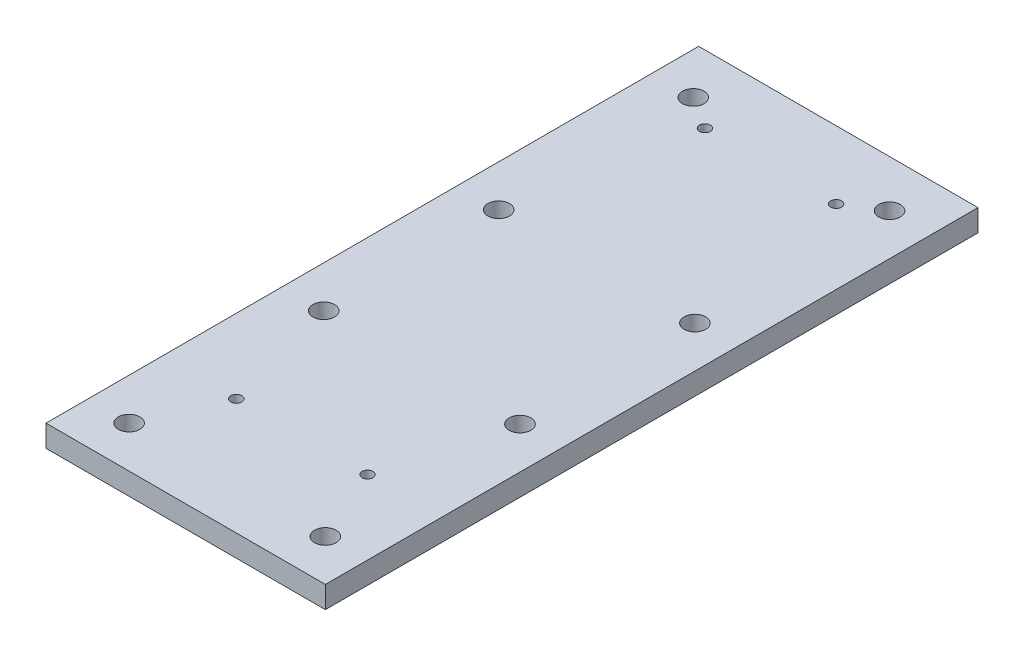
ISO-10303-21;
HEADER;
FILE_DESCRIPTION(('STEP AP214'),'2;1');
FILE_NAME('part.step','',(''),(''),'','','');
FILE_SCHEMA(('AUTOMOTIVE_DESIGN { 1 0 10303 214 1 1 1 1 }'));
ENDSEC;
DATA;
#1=APPLICATION_CONTEXT('core data for automotive mechanical design processes');
#2=APPLICATION_PROTOCOL_DEFINITION('international standard','automotive_design',2000,#1);
#3=PRODUCT_CONTEXT('',#1,'mechanical');
#4=PRODUCT('Part','Part','',(#3));
#5=PRODUCT_RELATED_PRODUCT_CATEGORY('part','',(#4));
#6=PRODUCT_DEFINITION_FORMATION('','',#4);
#7=PRODUCT_DEFINITION_CONTEXT('part definition',#1,'design');
#8=PRODUCT_DEFINITION('design','',#6,#7);
#9=PRODUCT_DEFINITION_SHAPE('','',#8);
#10=(LENGTH_UNIT() NAMED_UNIT(*) SI_UNIT(.MILLI.,.METRE.));
#11=(NAMED_UNIT(*) PLANE_ANGLE_UNIT() SI_UNIT($,.RADIAN.));
#12=(NAMED_UNIT(*) SI_UNIT($,.STERADIAN.) SOLID_ANGLE_UNIT());
#13=UNCERTAINTY_MEASURE_WITH_UNIT(LENGTH_MEASURE(1.E-05),#10,'distance_accuracy_value','');
#14=(GEOMETRIC_REPRESENTATION_CONTEXT(3) GLOBAL_UNCERTAINTY_ASSIGNED_CONTEXT((#13)) GLOBAL_UNIT_ASSIGNED_CONTEXT((#10,
#11,#12)) REPRESENTATION_CONTEXT('',''));
#15=CARTESIAN_POINT('',(0.,0.,0.));
#16=DIRECTION('',(0.,0.,1.));
#17=DIRECTION('',(1.,0.,0.));
#18=AXIS2_PLACEMENT_3D('',#15,#16,#17);
#19=CARTESIAN_POINT('',(0.,10.,0.));
#20=DIRECTION('',(0.,-1.,0.));
#21=DIRECTION('',(0.,0.,-1.));
#22=AXIS2_PLACEMENT_3D('',#19,#20,#21);
#23=PLANE('',#22);
#24=CARTESIAN_POINT('',(33.875,10.,-53.1375));
#25=DIRECTION('',(0.,1.,0.));
#26=DIRECTION('',(0.,0.,1.));
#27=AXIS2_PLACEMENT_3D('',#24,#25,#26);
#28=CIRCLE('',#27,2.5);
#29=CARTESIAN_POINT('',(33.875,10.,-50.6375));
#30=VERTEX_POINT('',#29);
#31=EDGE_CURVE('E178',#30,#30,#28,.T.);
#32=ORIENTED_EDGE('',*,*,#31,.F.);
#33=EDGE_LOOP('',(#32));
#34=FACE_BOUND('',#33,.T.);
#35=CARTESIAN_POINT('',(93.875,10.,-267.45));
#36=DIRECTION('',(0.,1.,0.));
#37=DIRECTION('',(0.,0.,1.));
#38=AXIS2_PLACEMENT_3D('',#35,#36,#37);
#39=CIRCLE('',#38,2.5);
#40=CARTESIAN_POINT('',(93.875,10.,-264.95));
#41=VERTEX_POINT('',#40);
#42=EDGE_CURVE('E184',#41,#41,#39,.T.);
#43=ORIENTED_EDGE('',*,*,#42,.F.);
#44=EDGE_LOOP('',(#43));
#45=FACE_BOUND('',#44,.T.);
#46=CARTESIAN_POINT('',(93.8750000000001,10.,-53.1375));
#47=DIRECTION('',(0.,1.,0.));
#48=DIRECTION('',(0.,0.,1.));
#49=AXIS2_PLACEMENT_3D('',#46,#47,#48);
#50=CIRCLE('',#49,2.5);
#51=CARTESIAN_POINT('',(93.8750000000001,10.,-50.6375));
#52=VERTEX_POINT('',#51);
#53=EDGE_CURVE('E172',#52,#52,#50,.T.);
#54=ORIENTED_EDGE('',*,*,#53,.F.);
#55=EDGE_LOOP('',(#54));
#56=FACE_BOUND('',#55,.T.);
#57=CARTESIAN_POINT('',(33.875,10.,-267.45));
#58=DIRECTION('',(0.,1.,0.));
#59=DIRECTION('',(0.,0.,1.));
#60=AXIS2_PLACEMENT_3D('',#57,#58,#59);
#61=CIRCLE('',#60,2.5);
#62=CARTESIAN_POINT('',(33.875,10.,-264.95));
#63=VERTEX_POINT('',#62);
#64=EDGE_CURVE('E169',#63,#63,#61,.T.);
#65=ORIENTED_EDGE('',*,*,#64,.F.);
#66=EDGE_LOOP('',(#65));
#67=FACE_BOUND('',#66,.T.);
#68=DIRECTION('',(0.,0.,1.));
#69=VECTOR('',#68,1.);
#70=CARTESIAN_POINT('',(0.,10.,0.));
#71=LINE('',#70,#69);
#72=CARTESIAN_POINT('',(0.,10.,-298.45));
#73=VERTEX_POINT('',#72);
#74=CARTESIAN_POINT('',(0.,10.,0.));
#75=VERTEX_POINT('',#74);
#76=EDGE_CURVE('E94',#73,#75,#71,.T.);
#77=ORIENTED_EDGE('',*,*,#76,.T.);
#78=DIRECTION('',(1.,0.,0.));
#79=VECTOR('',#78,1.);
#80=CARTESIAN_POINT('',(0.,10.,0.));
#81=LINE('',#80,#79);
#82=CARTESIAN_POINT('',(127.75,10.,0.));
#83=VERTEX_POINT('',#82);
#84=EDGE_CURVE('E89',#75,#83,#81,.T.);
#85=ORIENTED_EDGE('',*,*,#84,.T.);
#86=DIRECTION('',(0.,0.,-1.));
#87=VECTOR('',#86,1.);
#88=CARTESIAN_POINT('',(127.75,10.,0.));
#89=LINE('',#88,#87);
#90=CARTESIAN_POINT('',(127.75,10.,-298.45));
#91=VERTEX_POINT('',#90);
#92=EDGE_CURVE('E92',#83,#91,#89,.T.);
#93=ORIENTED_EDGE('',*,*,#92,.T.);
#94=DIRECTION('',(-1.,0.,0.));
#95=VECTOR('',#94,1.);
#96=CARTESIAN_POINT('',(0.,10.,-298.45));
#97=LINE('',#96,#95);
#98=EDGE_CURVE('E59',#91,#73,#97,.T.);
#99=ORIENTED_EDGE('',*,*,#98,.T.);
#100=EDGE_LOOP('',(#77,#85,#93,#99));
#101=FACE_BOUND('',#100,.T.);
#102=CARTESIAN_POINT('',(19.,10.,-277.));
#103=DIRECTION('',(0.,1.,0.));
#104=DIRECTION('',(0.,0.,1.));
#105=AXIS2_PLACEMENT_3D('',#102,#103,#104);
#106=CIRCLE('',#105,4.94999999999996);
#107=CARTESIAN_POINT('',(19.,10.,-272.05));
#108=VERTEX_POINT('',#107);
#109=EDGE_CURVE('E109',#108,#108,#106,.T.);
#110=ORIENTED_EDGE('',*,*,#109,.F.);
#111=EDGE_LOOP('',(#110));
#112=FACE_BOUND('',#111,.T.);
#113=CARTESIAN_POINT('',(108.75,10.,-108.));
#114=DIRECTION('',(0.,1.,0.));
#115=DIRECTION('',(0.,0.,1.));
#116=AXIS2_PLACEMENT_3D('',#113,#114,#115);
#117=CIRCLE('',#116,4.94999999999999);
#118=CARTESIAN_POINT('',(108.75,10.,-103.05));
#119=VERTEX_POINT('',#118);
#120=EDGE_CURVE('E124',#119,#119,#117,.T.);
#121=ORIENTED_EDGE('',*,*,#120,.F.);
#122=EDGE_LOOP('',(#121));
#123=FACE_BOUND('',#122,.T.);
#124=CARTESIAN_POINT('',(108.75,10.,-277.));
#125=DIRECTION('',(0.,1.,0.));
#126=DIRECTION('',(0.,0.,1.));
#127=AXIS2_PLACEMENT_3D('',#124,#125,#126);
#128=CIRCLE('',#127,4.94999999999995);
#129=CARTESIAN_POINT('',(108.75,10.,-272.05));
#130=VERTEX_POINT('',#129);
#131=EDGE_CURVE('E130',#130,#130,#128,.T.);
#132=ORIENTED_EDGE('',*,*,#131,.F.);
#133=EDGE_LOOP('',(#132));
#134=FACE_BOUND('',#133,.T.);
#135=CARTESIAN_POINT('',(19.,10.,-188.));
#136=DIRECTION('',(0.,1.,0.));
#137=DIRECTION('',(0.,0.,1.));
#138=AXIS2_PLACEMENT_3D('',#135,#136,#137);
#139=CIRCLE('',#138,4.95000000000001);
#140=CARTESIAN_POINT('',(19.,10.,-183.05));
#141=VERTEX_POINT('',#140);
#142=EDGE_CURVE('E136',#141,#141,#139,.T.);
#143=ORIENTED_EDGE('',*,*,#142,.F.);
#144=EDGE_LOOP('',(#143));
#145=FACE_BOUND('',#144,.T.);
#146=CARTESIAN_POINT('',(108.75,10.,-19.));
#147=DIRECTION('',(0.,1.,0.));
#148=DIRECTION('',(0.,0.,1.));
#149=AXIS2_PLACEMENT_3D('',#146,#147,#148);
#150=CIRCLE('',#149,4.94999999999999);
#151=CARTESIAN_POINT('',(108.75,10.,-14.05));
#152=VERTEX_POINT('',#151);
#153=EDGE_CURVE('E142',#152,#152,#150,.T.);
#154=ORIENTED_EDGE('',*,*,#153,.F.);
#155=EDGE_LOOP('',(#154));
#156=FACE_BOUND('',#155,.T.);
#157=CARTESIAN_POINT('',(108.75,10.,-188.));
#158=DIRECTION('',(0.,1.,0.));
#159=DIRECTION('',(0.,0.,1.));
#160=AXIS2_PLACEMENT_3D('',#157,#158,#159);
#161=CIRCLE('',#160,4.95);
#162=CARTESIAN_POINT('',(108.75,10.,-183.05));
#163=VERTEX_POINT('',#162);
#164=EDGE_CURVE('E148',#163,#163,#161,.T.);
#165=ORIENTED_EDGE('',*,*,#164,.F.);
#166=EDGE_LOOP('',(#165));
#167=FACE_BOUND('',#166,.T.);
#168=CARTESIAN_POINT('',(19.,10.,-108.));
#169=DIRECTION('',(0.,1.,0.));
#170=DIRECTION('',(0.,0.,1.));
#171=AXIS2_PLACEMENT_3D('',#168,#169,#170);
#172=CIRCLE('',#171,4.95);
#173=CARTESIAN_POINT('',(19.,10.,-103.05));
#174=VERTEX_POINT('',#173);
#175=EDGE_CURVE('E154',#174,#174,#172,.T.);
#176=ORIENTED_EDGE('',*,*,#175,.F.);
#177=EDGE_LOOP('',(#176));
#178=FACE_BOUND('',#177,.T.);
#179=CARTESIAN_POINT('',(19.,10.,-19.));
#180=DIRECTION('',(0.,1.,0.));
#181=DIRECTION('',(0.,0.,1.));
#182=AXIS2_PLACEMENT_3D('',#179,#180,#181);
#183=CIRCLE('',#182,4.95);
#184=CARTESIAN_POINT('',(19.,10.,-14.05));
#185=VERTEX_POINT('',#184);
#186=EDGE_CURVE('E160',#185,#185,#183,.T.);
#187=ORIENTED_EDGE('',*,*,#186,.F.);
#188=EDGE_LOOP('',(#187));
#189=FACE_BOUND('',#188,.T.);
#190=ADVANCED_FACE('F42',(#34,#45,#56,#67,#101,#112,#123,#134,#145,#156,#167,#178,#189),#23,.F.);
#191=CARTESIAN_POINT('',(0.,0.,0.));
#192=DIRECTION('',(0.,-1.,0.));
#193=DIRECTION('',(0.,0.,-1.));
#194=AXIS2_PLACEMENT_3D('',#191,#192,#193);
#195=PLANE('',#194);
#196=CARTESIAN_POINT('',(33.875,0.,-53.1375));
#197=DIRECTION('',(0.,1.,0.));
#198=DIRECTION('',(0.,0.,1.));
#199=AXIS2_PLACEMENT_3D('',#196,#197,#198);
#200=CIRCLE('',#199,2.5);
#201=CARTESIAN_POINT('',(33.875,0.,-50.6375));
#202=VERTEX_POINT('',#201);
#203=EDGE_CURVE('E175',#202,#202,#200,.T.);
#204=ORIENTED_EDGE('',*,*,#203,.T.);
#205=EDGE_LOOP('',(#204));
#206=FACE_BOUND('',#205,.T.);
#207=CARTESIAN_POINT('',(93.875,0.,-267.45));
#208=DIRECTION('',(0.,1.,0.));
#209=DIRECTION('',(0.,0.,1.));
#210=AXIS2_PLACEMENT_3D('',#207,#208,#209);
#211=CIRCLE('',#210,2.5);
#212=CARTESIAN_POINT('',(93.875,0.,-264.95));
#213=VERTEX_POINT('',#212);
#214=EDGE_CURVE('E181',#213,#213,#211,.T.);
#215=ORIENTED_EDGE('',*,*,#214,.T.);
#216=EDGE_LOOP('',(#215));
#217=FACE_BOUND('',#216,.T.);
#218=CARTESIAN_POINT('',(93.8750000000001,0.,-53.1375));
#219=DIRECTION('',(0.,1.,0.));
#220=DIRECTION('',(0.,0.,1.));
#221=AXIS2_PLACEMENT_3D('',#218,#219,#220);
#222=CIRCLE('',#221,2.5);
#223=CARTESIAN_POINT('',(93.8750000000001,0.,-50.6375));
#224=VERTEX_POINT('',#223);
#225=EDGE_CURVE('E187',#224,#224,#222,.T.);
#226=ORIENTED_EDGE('',*,*,#225,.T.);
#227=EDGE_LOOP('',(#226));
#228=FACE_BOUND('',#227,.T.);
#229=CARTESIAN_POINT('',(33.875,0.,-267.45));
#230=DIRECTION('',(0.,1.,0.));
#231=DIRECTION('',(0.,0.,1.));
#232=AXIS2_PLACEMENT_3D('',#229,#230,#231);
#233=CIRCLE('',#232,2.5);
#234=CARTESIAN_POINT('',(33.875,0.,-264.95));
#235=VERTEX_POINT('',#234);
#236=EDGE_CURVE('E166',#235,#235,#233,.T.);
#237=ORIENTED_EDGE('',*,*,#236,.T.);
#238=EDGE_LOOP('',(#237));
#239=FACE_BOUND('',#238,.T.);
#240=CARTESIAN_POINT('',(19.,0.,-108.));
#241=DIRECTION('',(0.,1.,0.));
#242=DIRECTION('',(0.,0.,1.));
#243=AXIS2_PLACEMENT_3D('',#240,#241,#242);
#244=CIRCLE('',#243,4.95);
#245=CARTESIAN_POINT('',(19.,0.,-103.05));
#246=VERTEX_POINT('',#245);
#247=EDGE_CURVE('E157',#246,#246,#244,.T.);
#248=ORIENTED_EDGE('',*,*,#247,.T.);
#249=EDGE_LOOP('',(#248));
#250=FACE_BOUND('',#249,.T.);
#251=CARTESIAN_POINT('',(108.75,0.,-19.));
#252=DIRECTION('',(0.,1.,0.));
#253=DIRECTION('',(0.,0.,1.));
#254=AXIS2_PLACEMENT_3D('',#251,#252,#253);
#255=CIRCLE('',#254,4.94999999999999);
#256=CARTESIAN_POINT('',(108.75,0.,-14.05));
#257=VERTEX_POINT('',#256);
#258=EDGE_CURVE('E145',#257,#257,#255,.T.);
#259=ORIENTED_EDGE('',*,*,#258,.T.);
#260=EDGE_LOOP('',(#259));
#261=FACE_BOUND('',#260,.T.);
#262=CARTESIAN_POINT('',(108.75,0.,-277.));
#263=DIRECTION('',(0.,1.,0.));
#264=DIRECTION('',(0.,0.,1.));
#265=AXIS2_PLACEMENT_3D('',#262,#263,#264);
#266=CIRCLE('',#265,4.94999999999995);
#267=CARTESIAN_POINT('',(108.75,0.,-272.05));
#268=VERTEX_POINT('',#267);
#269=EDGE_CURVE('E133',#268,#268,#266,.T.);
#270=ORIENTED_EDGE('',*,*,#269,.T.);
#271=EDGE_LOOP('',(#270));
#272=FACE_BOUND('',#271,.T.);
#273=CARTESIAN_POINT('',(19.,0.,-277.));
#274=DIRECTION('',(0.,1.,0.));
#275=DIRECTION('',(0.,0.,1.));
#276=AXIS2_PLACEMENT_3D('',#273,#274,#275);
#277=CIRCLE('',#276,4.94999999999996);
#278=CARTESIAN_POINT('',(19.,0.,-272.05));
#279=VERTEX_POINT('',#278);
#280=EDGE_CURVE('E121',#279,#279,#277,.T.);
#281=ORIENTED_EDGE('',*,*,#280,.T.);
#282=EDGE_LOOP('',(#281));
#283=FACE_BOUND('',#282,.T.);
#284=DIRECTION('',(0.,0.,1.));
#285=VECTOR('',#284,1.);
#286=CARTESIAN_POINT('',(0.,0.,0.));
#287=LINE('',#286,#285);
#288=CARTESIAN_POINT('',(0.,0.,-298.45));
#289=VERTEX_POINT('',#288);
#290=CARTESIAN_POINT('',(0.,0.,0.));
#291=VERTEX_POINT('',#290);
#292=EDGE_CURVE('E106',#289,#291,#287,.T.);
#293=ORIENTED_EDGE('',*,*,#292,.F.);
#294=DIRECTION('',(-1.,0.,0.));
#295=VECTOR('',#294,1.);
#296=CARTESIAN_POINT('',(0.,0.,-298.45));
#297=LINE('',#296,#295);
#298=CARTESIAN_POINT('',(127.75,0.,-298.45));
#299=VERTEX_POINT('',#298);
#300=EDGE_CURVE('E82',#299,#289,#297,.T.);
#301=ORIENTED_EDGE('',*,*,#300,.F.);
#302=DIRECTION('',(0.,0.,-1.));
#303=VECTOR('',#302,1.);
#304=CARTESIAN_POINT('',(127.75,0.,0.));
#305=LINE('',#304,#303);
#306=CARTESIAN_POINT('',(127.75,0.,0.));
#307=VERTEX_POINT('',#306);
#308=EDGE_CURVE('E76',#307,#299,#305,.T.);
#309=ORIENTED_EDGE('',*,*,#308,.F.);
#310=DIRECTION('',(1.,0.,0.));
#311=VECTOR('',#310,1.);
#312=CARTESIAN_POINT('',(0.,0.,0.));
#313=LINE('',#312,#311);
#314=EDGE_CURVE('E98',#291,#307,#313,.T.);
#315=ORIENTED_EDGE('',*,*,#314,.F.);
#316=EDGE_LOOP('',(#293,#301,#309,#315));
#317=FACE_BOUND('',#316,.T.);
#318=CARTESIAN_POINT('',(108.75,0.,-108.));
#319=DIRECTION('',(0.,1.,0.));
#320=DIRECTION('',(0.,0.,1.));
#321=AXIS2_PLACEMENT_3D('',#318,#319,#320);
#322=CIRCLE('',#321,4.94999999999999);
#323=CARTESIAN_POINT('',(108.75,0.,-103.05));
#324=VERTEX_POINT('',#323);
#325=EDGE_CURVE('E127',#324,#324,#322,.T.);
#326=ORIENTED_EDGE('',*,*,#325,.T.);
#327=EDGE_LOOP('',(#326));
#328=FACE_BOUND('',#327,.T.);
#329=CARTESIAN_POINT('',(19.,0.,-188.));
#330=DIRECTION('',(0.,1.,0.));
#331=DIRECTION('',(0.,0.,1.));
#332=AXIS2_PLACEMENT_3D('',#329,#330,#331);
#333=CIRCLE('',#332,4.95000000000001);
#334=CARTESIAN_POINT('',(19.,0.,-183.05));
#335=VERTEX_POINT('',#334);
#336=EDGE_CURVE('E139',#335,#335,#333,.T.);
#337=ORIENTED_EDGE('',*,*,#336,.T.);
#338=EDGE_LOOP('',(#337));
#339=FACE_BOUND('',#338,.T.);
#340=CARTESIAN_POINT('',(108.75,0.,-188.));
#341=DIRECTION('',(0.,1.,0.));
#342=DIRECTION('',(0.,0.,1.));
#343=AXIS2_PLACEMENT_3D('',#340,#341,#342);
#344=CIRCLE('',#343,4.95);
#345=CARTESIAN_POINT('',(108.75,0.,-183.05));
#346=VERTEX_POINT('',#345);
#347=EDGE_CURVE('E151',#346,#346,#344,.T.);
#348=ORIENTED_EDGE('',*,*,#347,.T.);
#349=EDGE_LOOP('',(#348));
#350=FACE_BOUND('',#349,.T.);
#351=CARTESIAN_POINT('',(19.,0.,-19.));
#352=DIRECTION('',(0.,1.,0.));
#353=DIRECTION('',(0.,0.,1.));
#354=AXIS2_PLACEMENT_3D('',#351,#352,#353);
#355=CIRCLE('',#354,4.95);
#356=CARTESIAN_POINT('',(19.,0.,-14.05));
#357=VERTEX_POINT('',#356);
#358=EDGE_CURVE('E163',#357,#357,#355,.T.);
#359=ORIENTED_EDGE('',*,*,#358,.T.);
#360=EDGE_LOOP('',(#359));
#361=FACE_BOUND('',#360,.T.);
#362=ADVANCED_FACE('F117',(#206,#217,#228,#239,#250,#261,#272,#283,#317,#328,#339,#350,#361),
#195,.T.);
#363=CARTESIAN_POINT('',(0.,10.,0.));
#364=DIRECTION('',(1.,0.,0.));
#365=DIRECTION('',(0.,0.,-1.));
#366=AXIS2_PLACEMENT_3D('',#363,#364,#365);
#367=PLANE('',#366);
#368=ORIENTED_EDGE('',*,*,#292,.T.);
#369=DIRECTION('',(0.,-1.,0.));
#370=VECTOR('',#369,1.);
#371=CARTESIAN_POINT('',(0.,10.,0.));
#372=LINE('',#371,#370);
#373=EDGE_CURVE('E11',#75,#291,#372,.T.);
#374=ORIENTED_EDGE('',*,*,#373,.F.);
#375=ORIENTED_EDGE('',*,*,#76,.F.);
#376=DIRECTION('',(0.,-1.,0.));
#377=VECTOR('',#376,1.);
#378=CARTESIAN_POINT('',(0.,10.,-298.45));
#379=LINE('',#378,#377);
#380=EDGE_CURVE('E102',#73,#289,#379,.T.);
#381=ORIENTED_EDGE('',*,*,#380,.T.);
#382=EDGE_LOOP('',(#368,#374,#375,#381));
#383=FACE_BOUND('',#382,.T.);
#384=ADVANCED_FACE('F44',(#383),#367,.F.);
#385=CARTESIAN_POINT('',(0.,10.,0.));
#386=DIRECTION('',(0.,0.,-1.));
#387=DIRECTION('',(-1.,0.,0.));
#388=AXIS2_PLACEMENT_3D('',#385,#386,#387);
#389=PLANE('',#388);
#390=ORIENTED_EDGE('',*,*,#314,.T.);
#391=DIRECTION('',(0.,-1.,0.));
#392=VECTOR('',#391,1.);
#393=CARTESIAN_POINT('',(127.75,10.,0.));
#394=LINE('',#393,#392);
#395=EDGE_CURVE('E51',#83,#307,#394,.T.);
#396=ORIENTED_EDGE('',*,*,#395,.F.);
#397=ORIENTED_EDGE('',*,*,#84,.F.);
#398=ORIENTED_EDGE('',*,*,#373,.T.);
#399=EDGE_LOOP('',(#390,#396,#397,#398));
#400=FACE_BOUND('',#399,.T.);
#401=ADVANCED_FACE('F97',(#400),#389,.F.);
#402=CARTESIAN_POINT('',(127.75,10.,0.));
#403=DIRECTION('',(-1.,0.,0.));
#404=DIRECTION('',(0.,0.,1.));
#405=AXIS2_PLACEMENT_3D('',#402,#403,#404);
#406=PLANE('',#405);
#407=ORIENTED_EDGE('',*,*,#308,.T.);
#408=DIRECTION('',(0.,-1.,0.));
#409=VECTOR('',#408,1.);
#410=CARTESIAN_POINT('',(127.75,10.,-298.45));
#411=LINE('',#410,#409);
#412=EDGE_CURVE('E99',#91,#299,#411,.T.);
#413=ORIENTED_EDGE('',*,*,#412,.F.);
#414=ORIENTED_EDGE('',*,*,#92,.F.);
#415=ORIENTED_EDGE('',*,*,#395,.T.);
#416=EDGE_LOOP('',(#407,#413,#414,#415));
#417=FACE_BOUND('',#416,.T.);
#418=ADVANCED_FACE('F100',(#417),#406,.F.);
#419=CARTESIAN_POINT('',(0.,10.,-298.45));
#420=DIRECTION('',(0.,0.,1.));
#421=DIRECTION('',(1.,0.,0.));
#422=AXIS2_PLACEMENT_3D('',#419,#420,#421);
#423=PLANE('',#422);
#424=ORIENTED_EDGE('',*,*,#300,.T.);
#425=ORIENTED_EDGE('',*,*,#380,.F.);
#426=ORIENTED_EDGE('',*,*,#98,.F.);
#427=ORIENTED_EDGE('',*,*,#412,.T.);
#428=EDGE_LOOP('',(#424,#425,#426,#427));
#429=FACE_BOUND('',#428,.T.);
#430=ADVANCED_FACE('F114',(#429),#423,.F.);
#431=CARTESIAN_POINT('',(19.,10.,-277.));
#432=DIRECTION('',(0.,-1.,0.));
#433=DIRECTION('',(0.,0.,-1.));
#434=AXIS2_PLACEMENT_3D('',#431,#432,#433);
#435=CYLINDRICAL_SURFACE('',#434,4.94999999999996);
#436=ORIENTED_EDGE('',*,*,#109,.T.);
#437=EDGE_LOOP('',(#436));
#438=FACE_BOUND('',#437,.T.);
#439=ORIENTED_EDGE('',*,*,#280,.F.);
#440=EDGE_LOOP('',(#439));
#441=FACE_BOUND('',#440,.T.);
#442=ADVANCED_FACE('F243',(#438,#441),#435,.F.);
#443=CARTESIAN_POINT('',(108.75,10.,-108.));
#444=DIRECTION('',(0.,-1.,0.));
#445=DIRECTION('',(0.,0.,-1.));
#446=AXIS2_PLACEMENT_3D('',#443,#444,#445);
#447=CYLINDRICAL_SURFACE('',#446,4.94999999999999);
#448=ORIENTED_EDGE('',*,*,#120,.T.);
#449=EDGE_LOOP('',(#448));
#450=FACE_BOUND('',#449,.T.);
#451=ORIENTED_EDGE('',*,*,#325,.F.);
#452=EDGE_LOOP('',(#451));
#453=FACE_BOUND('',#452,.T.);
#454=ADVANCED_FACE('F239',(#450,#453),#447,.F.);
#455=CARTESIAN_POINT('',(108.75,10.,-277.));
#456=DIRECTION('',(0.,-1.,0.));
#457=DIRECTION('',(0.,0.,-1.));
#458=AXIS2_PLACEMENT_3D('',#455,#456,#457);
#459=CYLINDRICAL_SURFACE('',#458,4.94999999999995);
#460=ORIENTED_EDGE('',*,*,#131,.T.);
#461=EDGE_LOOP('',(#460));
#462=FACE_BOUND('',#461,.T.);
#463=ORIENTED_EDGE('',*,*,#269,.F.);
#464=EDGE_LOOP('',(#463));
#465=FACE_BOUND('',#464,.T.);
#466=ADVANCED_FACE('F235',(#462,#465),#459,.F.);
#467=CARTESIAN_POINT('',(19.,10.,-188.));
#468=DIRECTION('',(0.,-1.,0.));
#469=DIRECTION('',(0.,0.,-1.));
#470=AXIS2_PLACEMENT_3D('',#467,#468,#469);
#471=CYLINDRICAL_SURFACE('',#470,4.95000000000001);
#472=ORIENTED_EDGE('',*,*,#142,.T.);
#473=EDGE_LOOP('',(#472));
#474=FACE_BOUND('',#473,.T.);
#475=ORIENTED_EDGE('',*,*,#336,.F.);
#476=EDGE_LOOP('',(#475));
#477=FACE_BOUND('',#476,.T.);
#478=ADVANCED_FACE('F231',(#474,#477),#471,.F.);
#479=CARTESIAN_POINT('',(108.75,10.,-19.));
#480=DIRECTION('',(0.,-1.,0.));
#481=DIRECTION('',(0.,0.,-1.));
#482=AXIS2_PLACEMENT_3D('',#479,#480,#481);
#483=CYLINDRICAL_SURFACE('',#482,4.94999999999999);
#484=ORIENTED_EDGE('',*,*,#153,.T.);
#485=EDGE_LOOP('',(#484));
#486=FACE_BOUND('',#485,.T.);
#487=ORIENTED_EDGE('',*,*,#258,.F.);
#488=EDGE_LOOP('',(#487));
#489=FACE_BOUND('',#488,.T.);
#490=ADVANCED_FACE('F227',(#486,#489),#483,.F.);
#491=CARTESIAN_POINT('',(108.75,10.,-188.));
#492=DIRECTION('',(0.,-1.,0.));
#493=DIRECTION('',(0.,0.,-1.));
#494=AXIS2_PLACEMENT_3D('',#491,#492,#493);
#495=CYLINDRICAL_SURFACE('',#494,4.95);
#496=ORIENTED_EDGE('',*,*,#164,.T.);
#497=EDGE_LOOP('',(#496));
#498=FACE_BOUND('',#497,.T.);
#499=ORIENTED_EDGE('',*,*,#347,.F.);
#500=EDGE_LOOP('',(#499));
#501=FACE_BOUND('',#500,.T.);
#502=ADVANCED_FACE('F223',(#498,#501),#495,.F.);
#503=CARTESIAN_POINT('',(19.,10.,-108.));
#504=DIRECTION('',(0.,-1.,0.));
#505=DIRECTION('',(0.,0.,-1.));
#506=AXIS2_PLACEMENT_3D('',#503,#504,#505);
#507=CYLINDRICAL_SURFACE('',#506,4.95);
#508=ORIENTED_EDGE('',*,*,#175,.T.);
#509=EDGE_LOOP('',(#508));
#510=FACE_BOUND('',#509,.T.);
#511=ORIENTED_EDGE('',*,*,#247,.F.);
#512=EDGE_LOOP('',(#511));
#513=FACE_BOUND('',#512,.T.);
#514=ADVANCED_FACE('F213',(#510,#513),#507,.F.);
#515=CARTESIAN_POINT('',(19.,10.,-19.));
#516=DIRECTION('',(0.,-1.,0.));
#517=DIRECTION('',(0.,0.,-1.));
#518=AXIS2_PLACEMENT_3D('',#515,#516,#517);
#519=CYLINDRICAL_SURFACE('',#518,4.95);
#520=ORIENTED_EDGE('',*,*,#186,.T.);
#521=EDGE_LOOP('',(#520));
#522=FACE_BOUND('',#521,.T.);
#523=ORIENTED_EDGE('',*,*,#358,.F.);
#524=EDGE_LOOP('',(#523));
#525=FACE_BOUND('',#524,.T.);
#526=ADVANCED_FACE('F203',(#522,#525),#519,.F.);
#527=CARTESIAN_POINT('',(33.875,0.,-267.45));
#528=DIRECTION('',(0.,1.,0.));
#529=DIRECTION('',(0.,0.,1.));
#530=AXIS2_PLACEMENT_3D('',#527,#528,#529);
#531=CYLINDRICAL_SURFACE('',#530,2.5);
#532=ORIENTED_EDGE('',*,*,#236,.F.);
#533=EDGE_LOOP('',(#532));
#534=FACE_BOUND('',#533,.T.);
#535=ORIENTED_EDGE('',*,*,#64,.T.);
#536=EDGE_LOOP('',(#535));
#537=FACE_BOUND('',#536,.T.);
#538=ADVANCED_FACE('F201',(#534,#537),#531,.F.);
#539=CARTESIAN_POINT('',(93.8750000000001,0.,-53.1375));
#540=DIRECTION('',(0.,1.,0.));
#541=DIRECTION('',(0.,0.,1.));
#542=AXIS2_PLACEMENT_3D('',#539,#540,#541);
#543=CYLINDRICAL_SURFACE('',#542,2.5);
#544=ORIENTED_EDGE('',*,*,#225,.F.);
#545=EDGE_LOOP('',(#544));
#546=FACE_BOUND('',#545,.T.);
#547=ORIENTED_EDGE('',*,*,#53,.T.);
#548=EDGE_LOOP('',(#547));
#549=FACE_BOUND('',#548,.T.);
#550=ADVANCED_FACE('F193',(#546,#549),#543,.F.);
#551=CARTESIAN_POINT('',(93.875,0.,-267.45));
#552=DIRECTION('',(0.,1.,0.));
#553=DIRECTION('',(0.,0.,1.));
#554=AXIS2_PLACEMENT_3D('',#551,#552,#553);
#555=CYLINDRICAL_SURFACE('',#554,2.5);
#556=ORIENTED_EDGE('',*,*,#214,.F.);
#557=EDGE_LOOP('',(#556));
#558=FACE_BOUND('',#557,.T.);
#559=ORIENTED_EDGE('',*,*,#42,.T.);
#560=EDGE_LOOP('',(#559));
#561=FACE_BOUND('',#560,.T.);
#562=ADVANCED_FACE('F210',(#558,#561),#555,.F.);
#563=CARTESIAN_POINT('',(33.875,0.,-53.1375));
#564=DIRECTION('',(0.,1.,0.));
#565=DIRECTION('',(0.,0.,1.));
#566=AXIS2_PLACEMENT_3D('',#563,#564,#565);
#567=CYLINDRICAL_SURFACE('',#566,2.5);
#568=ORIENTED_EDGE('',*,*,#203,.F.);
#569=EDGE_LOOP('',(#568));
#570=FACE_BOUND('',#569,.T.);
#571=ORIENTED_EDGE('',*,*,#31,.T.);
#572=EDGE_LOOP('',(#571));
#573=FACE_BOUND('',#572,.T.);
#574=ADVANCED_FACE('F218',(#570,#573),#567,.F.);
#575=CLOSED_SHELL('',(#190,#362,#384,#401,#418,#430,#442,#454,#466,#478,#490,#502,#514,#526,
#538,#550,#562,#574));
#576=MANIFOLD_SOLID_BREP('B2',#575);
#577=ADVANCED_BREP_SHAPE_REPRESENTATION('',(#18,#576),#14);
#578=SHAPE_DEFINITION_REPRESENTATION(#9,#577);
ENDSEC;
END-ISO-10303-21;
